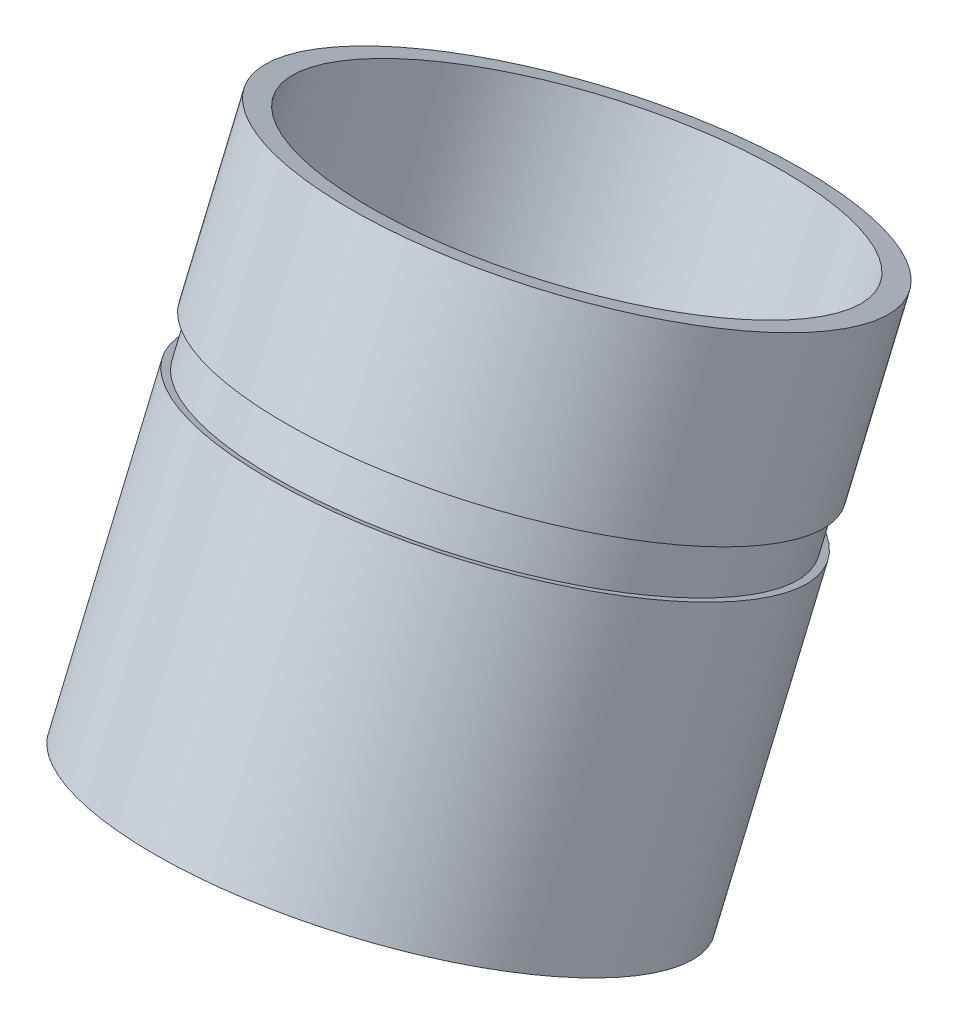
ISO-10303-21;
HEADER;
FILE_DESCRIPTION(('STEP AP214'),'2;1');
FILE_NAME('part.step','',(''),(''),'','','');
FILE_SCHEMA(('AUTOMOTIVE_DESIGN { 1 0 10303 214 1 1 1 1 }'));
ENDSEC;
DATA;
#1=APPLICATION_CONTEXT('core data for automotive mechanical design processes');
#2=APPLICATION_PROTOCOL_DEFINITION('international standard','automotive_design',2000,#1);
#3=PRODUCT_CONTEXT('',#1,'mechanical');
#4=PRODUCT('Part','Part','',(#3));
#5=PRODUCT_RELATED_PRODUCT_CATEGORY('part','',(#4));
#6=PRODUCT_DEFINITION_FORMATION('','',#4);
#7=PRODUCT_DEFINITION_CONTEXT('part definition',#1,'design');
#8=PRODUCT_DEFINITION('design','',#6,#7);
#9=PRODUCT_DEFINITION_SHAPE('','',#8);
#10=(LENGTH_UNIT() NAMED_UNIT(*) SI_UNIT(.MILLI.,.METRE.));
#11=(NAMED_UNIT(*) PLANE_ANGLE_UNIT() SI_UNIT($,.RADIAN.));
#12=(NAMED_UNIT(*) SI_UNIT($,.STERADIAN.) SOLID_ANGLE_UNIT());
#13=UNCERTAINTY_MEASURE_WITH_UNIT(LENGTH_MEASURE(1.E-05),#10,'distance_accuracy_value','');
#14=(GEOMETRIC_REPRESENTATION_CONTEXT(3) GLOBAL_UNCERTAINTY_ASSIGNED_CONTEXT((#13)) GLOBAL_UNIT_ASSIGNED_CONTEXT((#10,
#11,#12)) REPRESENTATION_CONTEXT('',''));
#15=CARTESIAN_POINT('',(0.,0.,0.));
#16=DIRECTION('',(0.,0.,1.));
#17=DIRECTION('',(1.,0.,0.));
#18=AXIS2_PLACEMENT_3D('',#15,#16,#17);
#19=CARTESIAN_POINT('',(-5.79782739300736E-13,-106.024322167768,306.773690271932));
#20=DIRECTION('',(0.,-0.920504853452441,0.390731128489271));
#21=DIRECTION('',(0.,-0.390731128489271,-0.920504853452441));
#22=AXIS2_PLACEMENT_3D('',#19,#20,#21);
#23=PLANE('',#22);
#24=CARTESIAN_POINT('',(-5.79782739300736E-13,-106.024322167768,306.773690271932));
#25=DIRECTION('',(0.,-0.920504853452441,0.390731128489271));
#26=DIRECTION('',(0.,-0.390731128489271,-0.920504853452441));
#27=AXIS2_PLACEMENT_3D('',#24,#25,#26);
#28=CIRCLE('',#27,18.3930374945531);
#29=CARTESIAN_POINT('',(-5.79782739300736E-13,-113.211054464361,289.842809988463));
#30=VERTEX_POINT('',#29);
#31=EDGE_CURVE('E69',#30,#30,#28,.T.);
#32=ORIENTED_EDGE('',*,*,#31,.F.);
#33=EDGE_LOOP('',(#32));
#34=FACE_BOUND('',#33,.T.);
#35=CARTESIAN_POINT('',(-5.79782739300736E-13,-106.024322167768,306.773690271932));
#36=DIRECTION('',(0.,-0.920504853452441,0.390731128489271));
#37=DIRECTION('',(0.,-0.390731128489271,-0.920504853452441));
#38=AXIS2_PLACEMENT_3D('',#35,#36,#37);
#39=CIRCLE('',#38,27.3930374945528);
#40=CARTESIAN_POINT('',(-5.79782739300736E-13,-116.727634620764,281.558266307391));
#41=VERTEX_POINT('',#40);
#42=EDGE_CURVE('E10',#41,#41,#39,.F.);
#43=ORIENTED_EDGE('',*,*,#42,.F.);
#44=EDGE_LOOP('',(#43));
#45=FACE_BOUND('',#44,.T.);
#46=ADVANCED_FACE('F39',(#34,#45),#23,.T.);
#47=CARTESIAN_POINT('',(-8.90177639048311E-13,-130.664094787499,317.232653226138));
#48=DIRECTION('',(0.,0.920504853452441,-0.390731128489271));
#49=DIRECTION('',(0.,0.390731128489271,0.920504853452441));
#50=AXIS2_PLACEMENT_3D('',#47,#48,#49);
#51=CYLINDRICAL_SURFACE('',#50,34.3930374945528);
#52=CARTESIAN_POINT('',(-8.90177639048311E-13,-130.664094787499,317.232653226138));
#53=DIRECTION('',(0.,-0.920504853452441,0.390731128489271));
#54=DIRECTION('',(0.,-0.390731128489271,-0.920504853452441));
#55=AXIS2_PLACEMENT_3D('',#52,#53,#54);
#56=CIRCLE('',#55,34.3930374945528);
#57=CARTESIAN_POINT('',(-8.90177639048311E-13,-144.102525139919,285.573695287431));
#58=VERTEX_POINT('',#57);
#59=EDGE_CURVE('E46',#58,#58,#56,.T.);
#60=ORIENTED_EDGE('',*,*,#59,.F.);
#61=EDGE_LOOP('',(#60));
#62=FACE_BOUND('',#61,.T.);
#63=CARTESIAN_POINT('',(-4.17440325448256E-13,-93.1372542194345,301.303454473082));
#64=DIRECTION('',(0.,0.920504853452441,-0.390731128489272));
#65=DIRECTION('',(0.,0.390731128489272,0.920504853452441));
#66=AXIS2_PLACEMENT_3D('',#63,#64,#65);
#67=CIRCLE('',#66,34.3930374945528);
#68=CARTESIAN_POINT('',(-4.17440325448256E-13,-79.698823867014,332.96241241179));
#69=VERTEX_POINT('',#68);
#70=EDGE_CURVE('E62',#69,#69,#67,.T.);
#71=ORIENTED_EDGE('',*,*,#70,.F.);
#72=EDGE_LOOP('',(#71));
#73=FACE_BOUND('',#72,.T.);
#74=ADVANCED_FACE('F41',(#62,#73),#51,.T.);
#75=CARTESIAN_POINT('',(0.,-66.2287550458278,289.881474231889));
#76=DIRECTION('',(0.,-0.920504853452441,0.390731128489271));
#77=DIRECTION('',(0.,-0.390731128489271,-0.920504853452441));
#78=AXIS2_PLACEMENT_3D('',#75,#76,#77);
#79=CIRCLE('',#78,34.3930374945528);
#80=CARTESIAN_POINT('',(0.,-79.6671853982483,258.222516293182));
#81=VERTEX_POINT('',#80);
#82=EDGE_CURVE('E50',#81,#81,#79,.T.);
#83=ORIENTED_EDGE('',*,*,#82,.T.);
#84=EDGE_LOOP('',(#83));
#85=FACE_BOUND('',#84,.T.);
#86=CARTESIAN_POINT('',(-3.47865005225762E-13,-87.6142250987198,298.959067702147));
#87=DIRECTION('',(0.,-0.920504853452441,0.390731128489272));
#88=DIRECTION('',(0.,-0.390731128489272,-0.920504853452441));
#89=AXIS2_PLACEMENT_3D('',#86,#87,#88);
#90=CIRCLE('',#89,34.3930374945528);
#91=CARTESIAN_POINT('',(-3.47865005225762E-13,-101.05265545114,267.300109763439));
#92=VERTEX_POINT('',#91);
#93=EDGE_CURVE('E60',#92,#92,#90,.T.);
#94=ORIENTED_EDGE('',*,*,#93,.F.);
#95=EDGE_LOOP('',(#94));
#96=FACE_BOUND('',#95,.T.);
#97=ADVANCED_FACE('F88',(#85,#96),#51,.T.);
#98=CARTESIAN_POINT('',(-8.90177639048311E-13,-130.664094787499,317.232653226138));
#99=DIRECTION('',(0.,0.920504853452441,-0.390731128489271));
#100=DIRECTION('',(0.,0.390731128489271,0.920504853452441));
#101=AXIS2_PLACEMENT_3D('',#98,#99,#100);
#102=CYLINDRICAL_SURFACE('',#101,31.3930374945529);
#103=CARTESIAN_POINT('',(0.,-66.2287550458278,289.881474231889));
#104=DIRECTION('',(0.,-0.920504853452441,0.390731128489271));
#105=DIRECTION('',(0.,-0.390731128489271,-0.920504853452441));
#106=AXIS2_PLACEMENT_3D('',#103,#104,#105);
#107=CIRCLE('',#106,31.3930374945529);
#108=CARTESIAN_POINT('',(0.,-78.4949920127804,260.984030853539));
#109=VERTEX_POINT('',#108);
#110=EDGE_CURVE('E55',#109,#109,#107,.T.);
#111=ORIENTED_EDGE('',*,*,#110,.F.);
#112=EDGE_LOOP('',(#111));
#113=FACE_BOUND('',#112,.T.);
#114=CARTESIAN_POINT('',(-3.47865005225759E-13,-87.6142250987196,298.959067702147));
#115=DIRECTION('',(0.,-0.920504853452441,0.390731128489271));
#116=DIRECTION('',(0.,-0.390731128489271,-0.920504853452441));
#117=AXIS2_PLACEMENT_3D('',#114,#115,#116);
#118=CIRCLE('',#117,31.3930374945528);
#119=CARTESIAN_POINT('',(-3.47865005225759E-13,-99.8804620656722,270.061624323796));
#120=VERTEX_POINT('',#119);
#121=EDGE_CURVE('E74',#120,#120,#118,.T.);
#122=ORIENTED_EDGE('',*,*,#121,.T.);
#123=EDGE_LOOP('',(#122));
#124=FACE_BOUND('',#123,.T.);
#125=ADVANCED_FACE('F85',(#113,#124),#102,.F.);
#126=CARTESIAN_POINT('',(-8.90177639048311E-13,-130.664094787499,317.232653226138));
#127=DIRECTION('',(0.,-0.920504853452441,0.390731128489271));
#128=DIRECTION('',(0.,-0.390731128489271,-0.920504853452441));
#129=AXIS2_PLACEMENT_3D('',#126,#127,#128);
#130=PLANE('',#129);
#131=ORIENTED_EDGE('',*,*,#59,.T.);
#132=EDGE_LOOP('',(#131));
#133=FACE_BOUND('',#132,.T.);
#134=CARTESIAN_POINT('',(-8.90177639048311E-13,-130.664094787499,317.232653226138));
#135=DIRECTION('',(0.,-0.920504853452441,0.390731128489271));
#136=DIRECTION('',(0.,-0.390731128489271,-0.920504853452441));
#137=AXIS2_PLACEMENT_3D('',#134,#135,#136);
#138=CIRCLE('',#137,27.3930374945528);
#139=CARTESIAN_POINT('',(-8.90177639048311E-13,-141.367407240494,292.017229261598));
#140=VERTEX_POINT('',#139);
#141=EDGE_CURVE('E153',#140,#140,#138,.T.);
#142=ORIENTED_EDGE('',*,*,#141,.F.);
#143=EDGE_LOOP('',(#142));
#144=FACE_BOUND('',#143,.T.);
#145=ADVANCED_FACE('F87',(#133,#144),#130,.T.);
#146=CARTESIAN_POINT('',(0.,-66.2287550458278,289.881474231889));
#147=DIRECTION('',(0.,-0.920504853452441,0.390731128489271));
#148=DIRECTION('',(0.,-0.390731128489271,-0.920504853452441));
#149=AXIS2_PLACEMENT_3D('',#146,#147,#148);
#150=PLANE('',#149);
#151=ORIENTED_EDGE('',*,*,#82,.F.);
#152=EDGE_LOOP('',(#151));
#153=FACE_BOUND('',#152,.T.);
#154=ORIENTED_EDGE('',*,*,#110,.T.);
#155=EDGE_LOOP('',(#154));
#156=FACE_BOUND('',#155,.T.);
#157=ADVANCED_FACE('F83',(#153,#156),#150,.F.);
#158=CARTESIAN_POINT('',(-3.47865005225759E-13,-87.6142250987196,298.959067702147));
#159=DIRECTION('',(0.,-0.920504853452441,0.390731128489271));
#160=DIRECTION('',(0.,-0.390731128489271,-0.920504853452441));
#161=AXIS2_PLACEMENT_3D('',#158,#159,#160);
#162=PLANE('',#161);
#163=ORIENTED_EDGE('',*,*,#121,.F.);
#164=EDGE_LOOP('',(#163));
#165=FACE_BOUND('',#164,.T.);
#166=CARTESIAN_POINT('',(-3.47865005225759E-13,-87.6142250987196,298.959067702147));
#167=DIRECTION('',(0.,-0.920504853452441,0.390731128489271));
#168=DIRECTION('',(0.,-0.390731128489271,-0.920504853452441));
#169=AXIS2_PLACEMENT_3D('',#166,#167,#168);
#170=CIRCLE('',#169,18.3930374945531);
#171=CARTESIAN_POINT('',(-3.47865005225759E-13,-94.8009573953118,282.028187418678));
#172=VERTEX_POINT('',#171);
#173=EDGE_CURVE('E65',#172,#172,#170,.T.);
#174=ORIENTED_EDGE('',*,*,#173,.T.);
#175=EDGE_LOOP('',(#174));
#176=FACE_BOUND('',#175,.T.);
#177=ADVANCED_FACE('F112',(#165,#176),#162,.F.);
#178=CARTESIAN_POINT('',(-5.79782739300736E-13,-106.024322167768,306.773690271932));
#179=DIRECTION('',(0.,0.920504853452441,-0.390731128489271));
#180=DIRECTION('',(0.,0.390731128489271,0.920504853452441));
#181=AXIS2_PLACEMENT_3D('',#178,#179,#180);
#182=CYLINDRICAL_SURFACE('',#181,18.3930374945531);
#183=ORIENTED_EDGE('',*,*,#31,.T.);
#184=EDGE_LOOP('',(#183));
#185=FACE_BOUND('',#184,.T.);
#186=ORIENTED_EDGE('',*,*,#173,.F.);
#187=EDGE_LOOP('',(#186));
#188=FACE_BOUND('',#187,.T.);
#189=ADVANCED_FACE('F110',(#185,#188),#182,.F.);
#190=CARTESIAN_POINT('',(33.393037494552,-93.1372542194345,301.303454473082));
#191=DIRECTION('',(0.,0.920504853452441,-0.390731128489272));
#192=DIRECTION('',(0.,0.390731128489272,0.920504853452441));
#193=AXIS2_PLACEMENT_3D('',#190,#191,#192);
#194=PLANE('',#193);
#195=CARTESIAN_POINT('',(-8.66582785162124E-13,-93.1372542194345,301.303454473082));
#196=DIRECTION('',(0.,0.920504853452441,-0.390731128489272));
#197=DIRECTION('',(0.,0.390731128489272,0.920504853452441));
#198=AXIS2_PLACEMENT_3D('',#195,#196,#197);
#199=CIRCLE('',#198,33.3930374945528);
#200=CARTESIAN_POINT('',(-8.66582785162124E-13,-80.0895549955033,332.041907558338));
#201=VERTEX_POINT('',#200);
#202=EDGE_CURVE('E63',#201,#201,#199,.T.);
#203=ORIENTED_EDGE('',*,*,#202,.F.);
#204=EDGE_LOOP('',(#203));
#205=FACE_BOUND('',#204,.T.);
#206=ORIENTED_EDGE('',*,*,#70,.T.);
#207=EDGE_LOOP('',(#206));
#208=FACE_BOUND('',#207,.T.);
#209=ADVANCED_FACE('F120',(#205,#208),#194,.T.);
#210=CARTESIAN_POINT('',(37.0699232245033,-87.6142250987198,298.959067702147));
#211=DIRECTION('',(0.,-0.920504853452441,0.390731128489272));
#212=DIRECTION('',(0.,-0.390731128489272,-0.920504853452441));
#213=AXIS2_PLACEMENT_3D('',#210,#211,#212);
#214=PLANE('',#213);
#215=CARTESIAN_POINT('',(-8.63154236899268E-13,-87.6142250987198,298.959067702147));
#216=DIRECTION('',(0.,0.920504853452441,-0.390731128489272));
#217=DIRECTION('',(0.,0.390731128489272,0.920504853452441));
#218=AXIS2_PLACEMENT_3D('',#215,#216,#217);
#219=CIRCLE('',#218,33.3930374945528);
#220=CARTESIAN_POINT('',(-8.63154236899268E-13,-74.5665258747886,329.697520787402));
#221=VERTEX_POINT('',#220);
#222=EDGE_CURVE('E155',#221,#221,#219,.T.);
#223=ORIENTED_EDGE('',*,*,#222,.T.);
#224=EDGE_LOOP('',(#223));
#225=FACE_BOUND('',#224,.T.);
#226=ORIENTED_EDGE('',*,*,#93,.T.);
#227=EDGE_LOOP('',(#226));
#228=FACE_BOUND('',#227,.T.);
#229=ADVANCED_FACE('F130',(#225,#228),#214,.T.);
#230=CARTESIAN_POINT('',(-8.49878710988097E-13,-66.2287550458275,289.881474231889));
#231=DIRECTION('',(0.,0.920504853452441,-0.390731128489272));
#232=DIRECTION('',(0.,0.390731128489272,0.920504853452441));
#233=AXIS2_PLACEMENT_3D('',#230,#231,#232);
#234=CYLINDRICAL_SURFACE('',#233,33.3930374945528);
#235=ORIENTED_EDGE('',*,*,#202,.T.);
#236=EDGE_LOOP('',(#235));
#237=FACE_BOUND('',#236,.T.);
#238=ORIENTED_EDGE('',*,*,#222,.F.);
#239=EDGE_LOOP('',(#238));
#240=FACE_BOUND('',#239,.T.);
#241=ADVANCED_FACE('F132',(#237,#240),#234,.T.);
#242=CARTESIAN_POINT('',(-1.91981026529048E-12,-212.398407474642,351.926810582032));
#243=DIRECTION('',(0.,0.920504853452441,-0.390731128489271));
#244=DIRECTION('',(0.,0.390731128489271,0.920504853452441));
#245=AXIS2_PLACEMENT_3D('',#242,#243,#244);
#246=CYLINDRICAL_SURFACE('',#245,27.3930374945528);
#247=ORIENTED_EDGE('',*,*,#42,.T.);
#248=EDGE_LOOP('',(#247));
#249=FACE_BOUND('',#248,.T.);
#250=ORIENTED_EDGE('',*,*,#141,.T.);
#251=EDGE_LOOP('',(#250));
#252=FACE_BOUND('',#251,.T.);
#253=ADVANCED_FACE('F140',(#249,#252),#246,.F.);
#254=CLOSED_SHELL('',(#46,#74,#97,#125,#145,#157,#177,#189,#209,#229,#241,#253));
#255=MANIFOLD_SOLID_BREP('B2',#254);
#256=ADVANCED_BREP_SHAPE_REPRESENTATION('',(#18,#255),#14);
#257=SHAPE_DEFINITION_REPRESENTATION(#9,#256);
ENDSEC;
END-ISO-10303-21;
